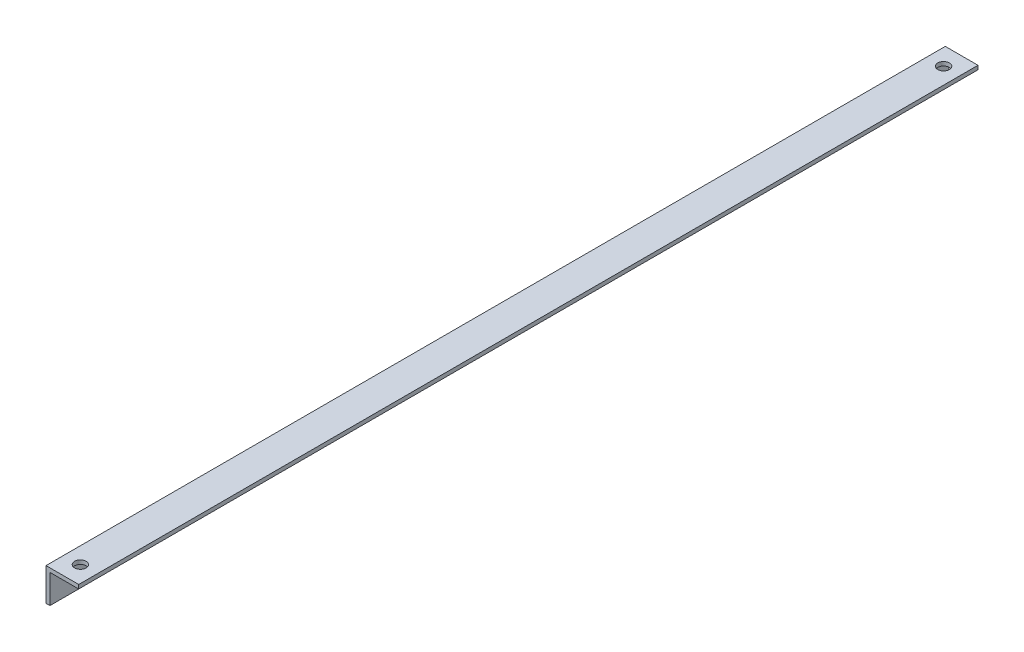
ISO-10303-21;
HEADER;
FILE_DESCRIPTION(('STEP AP214'),'2;1');
FILE_NAME('part.step','',(''),(''),'','','');
FILE_SCHEMA(('AUTOMOTIVE_DESIGN { 1 0 10303 214 1 1 1 1 }'));
ENDSEC;
DATA;
#1=APPLICATION_CONTEXT('core data for automotive mechanical design processes');
#2=APPLICATION_PROTOCOL_DEFINITION('international standard','automotive_design',2000,#1);
#3=PRODUCT_CONTEXT('',#1,'mechanical');
#4=PRODUCT('Part','Part','',(#3));
#5=PRODUCT_RELATED_PRODUCT_CATEGORY('part','',(#4));
#6=PRODUCT_DEFINITION_FORMATION('','',#4);
#7=PRODUCT_DEFINITION_CONTEXT('part definition',#1,'design');
#8=PRODUCT_DEFINITION('design','',#6,#7);
#9=PRODUCT_DEFINITION_SHAPE('','',#8);
#10=(LENGTH_UNIT() NAMED_UNIT(*) SI_UNIT(.MILLI.,.METRE.));
#11=(NAMED_UNIT(*) PLANE_ANGLE_UNIT() SI_UNIT($,.RADIAN.));
#12=(NAMED_UNIT(*) SI_UNIT($,.STERADIAN.) SOLID_ANGLE_UNIT());
#13=UNCERTAINTY_MEASURE_WITH_UNIT(LENGTH_MEASURE(1.E-05),#10,'distance_accuracy_value','');
#14=(GEOMETRIC_REPRESENTATION_CONTEXT(3) GLOBAL_UNCERTAINTY_ASSIGNED_CONTEXT((#13)) GLOBAL_UNIT_ASSIGNED_CONTEXT((#10,
#11,#12)) REPRESENTATION_CONTEXT('',''));
#15=CARTESIAN_POINT('',(0.,0.,0.));
#16=DIRECTION('',(0.,0.,1.));
#17=DIRECTION('',(1.,0.,0.));
#18=AXIS2_PLACEMENT_3D('',#15,#16,#17);
#19=CARTESIAN_POINT('',(0.,-12.7,349.));
#20=DIRECTION('',(1.,0.,0.));
#21=DIRECTION('',(0.,0.,-1.));
#22=AXIS2_PLACEMENT_3D('',#19,#20,#21);
#23=PLANE('',#22);
#24=CARTESIAN_POINT('',(0.,-6.35000000000005,65.553973));
#25=DIRECTION('',(-1.,0.,0.));
#26=DIRECTION('',(0.,0.,1.));
#27=AXIS2_PLACEMENT_3D('',#24,#25,#26);
#28=CIRCLE('',#27,1.65);
#29=CARTESIAN_POINT('',(0.,-6.35000000000005,67.203973));
#30=VERTEX_POINT('',#29);
#31=EDGE_CURVE('E202',#30,#30,#28,.T.);
#32=ORIENTED_EDGE('',*,*,#31,.F.);
#33=EDGE_LOOP('',(#32));
#34=FACE_BOUND('',#33,.T.);
#35=CARTESIAN_POINT('',(0.,-6.35000000000002,283.446027));
#36=DIRECTION('',(-1.,0.,0.));
#37=DIRECTION('',(0.,0.,1.));
#38=AXIS2_PLACEMENT_3D('',#35,#36,#37);
#39=CIRCLE('',#38,1.65);
#40=CARTESIAN_POINT('',(0.,-6.35000000000002,285.096027));
#41=VERTEX_POINT('',#40);
#42=EDGE_CURVE('E194',#41,#41,#39,.T.);
#43=ORIENTED_EDGE('',*,*,#42,.F.);
#44=EDGE_LOOP('',(#43));
#45=FACE_BOUND('',#44,.T.);
#46=DIRECTION('',(0.,-1.,0.));
#47=VECTOR('',#46,1.);
#48=CARTESIAN_POINT('',(0.,-12.7,0.));
#49=LINE('',#48,#47);
#50=CARTESIAN_POINT('',(0.,0.,0.));
#51=VERTEX_POINT('',#50);
#52=CARTESIAN_POINT('',(0.,-12.7,0.));
#53=VERTEX_POINT('',#52);
#54=EDGE_CURVE('E143',#51,#53,#49,.T.);
#55=ORIENTED_EDGE('',*,*,#54,.T.);
#56=DIRECTION('',(0.,0.,-1.));
#57=VECTOR('',#56,1.);
#58=CARTESIAN_POINT('',(0.,-12.7,349.));
#59=LINE('',#58,#57);
#60=CARTESIAN_POINT('',(0.,-12.7,349.));
#61=VERTEX_POINT('',#60);
#62=EDGE_CURVE('E11',#61,#53,#59,.T.);
#63=ORIENTED_EDGE('',*,*,#62,.F.);
#64=DIRECTION('',(0.,-1.,0.));
#65=VECTOR('',#64,1.);
#66=CARTESIAN_POINT('',(0.,-12.7,349.));
#67=LINE('',#66,#65);
#68=CARTESIAN_POINT('',(0.,0.,349.));
#69=VERTEX_POINT('',#68);
#70=EDGE_CURVE('E160',#69,#61,#67,.T.);
#71=ORIENTED_EDGE('',*,*,#70,.F.);
#72=DIRECTION('',(0.,0.,-1.));
#73=VECTOR('',#72,1.);
#74=CARTESIAN_POINT('',(0.,0.,349.));
#75=LINE('',#74,#73);
#76=EDGE_CURVE('E139',#69,#51,#75,.T.);
#77=ORIENTED_EDGE('',*,*,#76,.T.);
#78=EDGE_LOOP('',(#55,#63,#71,#77));
#79=FACE_BOUND('',#78,.T.);
#80=ADVANCED_FACE('F39',(#34,#45,#79),#23,.F.);
#81=CARTESIAN_POINT('',(1.524,-12.7,349.));
#82=DIRECTION('',(0.,1.,0.));
#83=DIRECTION('',(0.,0.,1.));
#84=AXIS2_PLACEMENT_3D('',#81,#82,#83);
#85=PLANE('',#84);
#86=DIRECTION('',(1.,0.,0.));
#87=VECTOR('',#86,1.);
#88=CARTESIAN_POINT('',(1.524,-12.7,0.));
#89=LINE('',#88,#87);
#90=CARTESIAN_POINT('',(1.524,-12.7,0.));
#91=VERTEX_POINT('',#90);
#92=EDGE_CURVE('E147',#53,#91,#89,.T.);
#93=ORIENTED_EDGE('',*,*,#92,.T.);
#94=DIRECTION('',(0.,0.,-1.));
#95=VECTOR('',#94,1.);
#96=CARTESIAN_POINT('',(1.524,-12.7,349.));
#97=LINE('',#96,#95);
#98=CARTESIAN_POINT('',(1.524,-12.7,349.));
#99=VERTEX_POINT('',#98);
#100=EDGE_CURVE('E49',#99,#91,#97,.T.);
#101=ORIENTED_EDGE('',*,*,#100,.F.);
#102=DIRECTION('',(1.,0.,0.));
#103=VECTOR('',#102,1.);
#104=CARTESIAN_POINT('',(1.524,-12.7,349.));
#105=LINE('',#104,#103);
#106=EDGE_CURVE('E105',#61,#99,#105,.T.);
#107=ORIENTED_EDGE('',*,*,#106,.F.);
#108=ORIENTED_EDGE('',*,*,#62,.T.);
#109=EDGE_LOOP('',(#93,#101,#107,#108));
#110=FACE_BOUND('',#109,.T.);
#111=ADVANCED_FACE('F224',(#110),#85,.F.);
#112=CARTESIAN_POINT('',(1.524,-1.524,349.));
#113=DIRECTION('',(-1.,0.,0.));
#114=DIRECTION('',(0.,-1.,0.));
#115=AXIS2_PLACEMENT_3D('',#112,#113,#114);
#116=PLANE('',#115);
#117=CARTESIAN_POINT('',(1.524,-6.35000000000005,65.553973));
#118=DIRECTION('',(-1.,0.,0.));
#119=DIRECTION('',(0.,-1.,0.));
#120=AXIS2_PLACEMENT_3D('',#117,#118,#119);
#121=CIRCLE('',#120,1.65);
#122=CARTESIAN_POINT('',(1.524,-8.00000000000005,65.553973));
#123=VERTEX_POINT('',#122);
#124=EDGE_CURVE('E42',#123,#123,#121,.T.);
#125=ORIENTED_EDGE('',*,*,#124,.T.);
#126=EDGE_LOOP('',(#125));
#127=FACE_BOUND('',#126,.T.);
#128=CARTESIAN_POINT('',(1.524,-6.35000000000002,283.446027));
#129=DIRECTION('',(-1.,0.,0.));
#130=DIRECTION('',(0.,-1.,0.));
#131=AXIS2_PLACEMENT_3D('',#128,#129,#130);
#132=CIRCLE('',#131,1.65);
#133=CARTESIAN_POINT('',(1.524,-8.00000000000002,283.446027));
#134=VERTEX_POINT('',#133);
#135=EDGE_CURVE('E192',#134,#134,#132,.T.);
#136=ORIENTED_EDGE('',*,*,#135,.T.);
#137=EDGE_LOOP('',(#136));
#138=FACE_BOUND('',#137,.T.);
#139=DIRECTION('',(0.,1.,0.));
#140=VECTOR('',#139,1.);
#141=CARTESIAN_POINT('',(1.524,-1.524,0.));
#142=LINE('',#141,#140);
#143=CARTESIAN_POINT('',(1.524,-1.524,0.));
#144=VERTEX_POINT('',#143);
#145=EDGE_CURVE('E151',#91,#144,#142,.T.);
#146=ORIENTED_EDGE('',*,*,#145,.T.);
#147=DIRECTION('',(0.,0.,-1.));
#148=VECTOR('',#147,1.);
#149=CARTESIAN_POINT('',(1.524,-1.524,349.));
#150=LINE('',#149,#148);
#151=CARTESIAN_POINT('',(1.524,-1.524,349.));
#152=VERTEX_POINT('',#151);
#153=EDGE_CURVE('E131',#152,#144,#150,.T.);
#154=ORIENTED_EDGE('',*,*,#153,.F.);
#155=DIRECTION('',(0.,1.,0.));
#156=VECTOR('',#155,1.);
#157=CARTESIAN_POINT('',(1.524,-1.524,349.));
#158=LINE('',#157,#156);
#159=EDGE_CURVE('E120',#99,#152,#158,.T.);
#160=ORIENTED_EDGE('',*,*,#159,.F.);
#161=ORIENTED_EDGE('',*,*,#100,.T.);
#162=EDGE_LOOP('',(#146,#154,#160,#161));
#163=FACE_BOUND('',#162,.T.);
#164=ADVANCED_FACE('F211',(#127,#138,#163),#116,.F.);
#165=CARTESIAN_POINT('',(12.7,-1.524,349.));
#166=DIRECTION('',(0.,1.,0.));
#167=DIRECTION('',(-1.,0.,0.));
#168=AXIS2_PLACEMENT_3D('',#165,#166,#167);
#169=PLANE('',#168);
#170=CARTESIAN_POINT('',(6.35,-1.524,7.));
#171=DIRECTION('',(0.,1.,0.));
#172=DIRECTION('',(-1.,0.,0.));
#173=AXIS2_PLACEMENT_3D('',#170,#171,#172);
#174=CIRCLE('',#173,2.24999999999997);
#175=CARTESIAN_POINT('',(4.10000000000003,-1.524,7.));
#176=VERTEX_POINT('',#175);
#177=EDGE_CURVE('E177',#176,#176,#174,.T.);
#178=ORIENTED_EDGE('',*,*,#177,.T.);
#179=EDGE_LOOP('',(#178));
#180=FACE_BOUND('',#179,.T.);
#181=CARTESIAN_POINT('',(6.35,-1.524,342.));
#182=DIRECTION('',(0.,1.,0.));
#183=DIRECTION('',(-1.,0.,0.));
#184=AXIS2_PLACEMENT_3D('',#181,#182,#183);
#185=CIRCLE('',#184,2.24999999999997);
#186=CARTESIAN_POINT('',(4.10000000000003,-1.524,342.));
#187=VERTEX_POINT('',#186);
#188=EDGE_CURVE('E148',#187,#187,#185,.T.);
#189=ORIENTED_EDGE('',*,*,#188,.T.);
#190=EDGE_LOOP('',(#189));
#191=FACE_BOUND('',#190,.T.);
#192=DIRECTION('',(1.,0.,0.));
#193=VECTOR('',#192,1.);
#194=CARTESIAN_POINT('',(12.7,-1.524,0.));
#195=LINE('',#194,#193);
#196=CARTESIAN_POINT('',(12.7,-1.524,0.));
#197=VERTEX_POINT('',#196);
#198=EDGE_CURVE('E129',#144,#197,#195,.T.);
#199=ORIENTED_EDGE('',*,*,#198,.T.);
#200=DIRECTION('',(0.,0.,-1.));
#201=VECTOR('',#200,1.);
#202=CARTESIAN_POINT('',(12.7,-1.524,349.));
#203=LINE('',#202,#201);
#204=CARTESIAN_POINT('',(12.7,-1.524,349.));
#205=VERTEX_POINT('',#204);
#206=EDGE_CURVE('E126',#205,#197,#203,.T.);
#207=ORIENTED_EDGE('',*,*,#206,.F.);
#208=DIRECTION('',(1.,0.,0.));
#209=VECTOR('',#208,1.);
#210=CARTESIAN_POINT('',(12.7,-1.524,349.));
#211=LINE('',#210,#209);
#212=EDGE_CURVE('E114',#152,#205,#211,.T.);
#213=ORIENTED_EDGE('',*,*,#212,.F.);
#214=ORIENTED_EDGE('',*,*,#153,.T.);
#215=EDGE_LOOP('',(#199,#207,#213,#214));
#216=FACE_BOUND('',#215,.T.);
#217=ADVANCED_FACE('F127',(#180,#191,#216),#169,.F.);
#218=CARTESIAN_POINT('',(12.7,0.,349.));
#219=DIRECTION('',(-1.,0.,0.));
#220=DIRECTION('',(0.,0.,1.));
#221=AXIS2_PLACEMENT_3D('',#218,#219,#220);
#222=PLANE('',#221);
#223=DIRECTION('',(0.,1.,0.));
#224=VECTOR('',#223,1.);
#225=CARTESIAN_POINT('',(12.7,0.,0.));
#226=LINE('',#225,#224);
#227=CARTESIAN_POINT('',(12.7,0.,0.));
#228=VERTEX_POINT('',#227);
#229=EDGE_CURVE('E89',#197,#228,#226,.T.);
#230=ORIENTED_EDGE('',*,*,#229,.T.);
#231=DIRECTION('',(0.,0.,-1.));
#232=VECTOR('',#231,1.);
#233=CARTESIAN_POINT('',(12.7,0.,349.));
#234=LINE('',#233,#232);
#235=CARTESIAN_POINT('',(12.7,0.,349.));
#236=VERTEX_POINT('',#235);
#237=EDGE_CURVE('E132',#236,#228,#234,.T.);
#238=ORIENTED_EDGE('',*,*,#237,.F.);
#239=DIRECTION('',(0.,1.,0.));
#240=VECTOR('',#239,1.);
#241=CARTESIAN_POINT('',(12.7,0.,349.));
#242=LINE('',#241,#240);
#243=EDGE_CURVE('E118',#205,#236,#242,.T.);
#244=ORIENTED_EDGE('',*,*,#243,.F.);
#245=ORIENTED_EDGE('',*,*,#206,.T.);
#246=EDGE_LOOP('',(#230,#238,#244,#245));
#247=FACE_BOUND('',#246,.T.);
#248=ADVANCED_FACE('F134',(#247),#222,.F.);
#249=CARTESIAN_POINT('',(0.,0.,349.));
#250=DIRECTION('',(0.,-1.,0.));
#251=DIRECTION('',(0.,0.,-1.));
#252=AXIS2_PLACEMENT_3D('',#249,#250,#251);
#253=PLANE('',#252);
#254=CARTESIAN_POINT('',(6.35,0.,7.));
#255=DIRECTION('',(0.,1.,0.));
#256=DIRECTION('',(0.,0.,1.));
#257=AXIS2_PLACEMENT_3D('',#254,#255,#256);
#258=CIRCLE('',#257,2.24999999999999);
#259=CARTESIAN_POINT('',(6.35,0.,9.24999999999999));
#260=VERTEX_POINT('',#259);
#261=EDGE_CURVE('E183',#260,#260,#258,.T.);
#262=ORIENTED_EDGE('',*,*,#261,.F.);
#263=EDGE_LOOP('',(#262));
#264=FACE_BOUND('',#263,.T.);
#265=CARTESIAN_POINT('',(6.35,0.,342.));
#266=DIRECTION('',(0.,1.,0.));
#267=DIRECTION('',(0.,0.,1.));
#268=AXIS2_PLACEMENT_3D('',#265,#266,#267);
#269=CIRCLE('',#268,2.24999999999999);
#270=CARTESIAN_POINT('',(6.35,0.,344.25));
#271=VERTEX_POINT('',#270);
#272=EDGE_CURVE('E171',#271,#271,#269,.T.);
#273=ORIENTED_EDGE('',*,*,#272,.F.);
#274=EDGE_LOOP('',(#273));
#275=FACE_BOUND('',#274,.T.);
#276=DIRECTION('',(-1.,0.,0.));
#277=VECTOR('',#276,1.);
#278=CARTESIAN_POINT('',(0.,0.,0.));
#279=LINE('',#278,#277);
#280=EDGE_CURVE('E96',#228,#51,#279,.T.);
#281=ORIENTED_EDGE('',*,*,#280,.T.);
#282=ORIENTED_EDGE('',*,*,#76,.F.);
#283=DIRECTION('',(-1.,0.,0.));
#284=VECTOR('',#283,1.);
#285=CARTESIAN_POINT('',(0.,0.,349.));
#286=LINE('',#285,#284);
#287=EDGE_CURVE('E61',#236,#69,#286,.T.);
#288=ORIENTED_EDGE('',*,*,#287,.F.);
#289=ORIENTED_EDGE('',*,*,#237,.T.);
#290=EDGE_LOOP('',(#281,#282,#288,#289));
#291=FACE_BOUND('',#290,.T.);
#292=ADVANCED_FACE('F249',(#264,#275,#291),#253,.F.);
#293=CARTESIAN_POINT('',(0.,0.,349.));
#294=DIRECTION('',(0.,0.,-1.));
#295=DIRECTION('',(-1.,0.,0.));
#296=AXIS2_PLACEMENT_3D('',#293,#294,#295);
#297=PLANE('',#296);
#298=ORIENTED_EDGE('',*,*,#70,.T.);
#299=ORIENTED_EDGE('',*,*,#106,.T.);
#300=ORIENTED_EDGE('',*,*,#159,.T.);
#301=ORIENTED_EDGE('',*,*,#212,.T.);
#302=ORIENTED_EDGE('',*,*,#243,.T.);
#303=ORIENTED_EDGE('',*,*,#287,.T.);
#304=EDGE_LOOP('',(#298,#299,#300,#301,#302,#303));
#305=FACE_BOUND('',#304,.T.);
#306=ADVANCED_FACE('F116',(#305),#297,.F.);
#307=CARTESIAN_POINT('',(0.,0.,0.));
#308=DIRECTION('',(0.,0.,-1.));
#309=DIRECTION('',(-1.,0.,0.));
#310=AXIS2_PLACEMENT_3D('',#307,#308,#309);
#311=PLANE('',#310);
#312=ORIENTED_EDGE('',*,*,#54,.F.);
#313=ORIENTED_EDGE('',*,*,#280,.F.);
#314=ORIENTED_EDGE('',*,*,#229,.F.);
#315=ORIENTED_EDGE('',*,*,#198,.F.);
#316=ORIENTED_EDGE('',*,*,#145,.F.);
#317=ORIENTED_EDGE('',*,*,#92,.F.);
#318=EDGE_LOOP('',(#312,#313,#314,#315,#316,#317));
#319=FACE_BOUND('',#318,.T.);
#320=ADVANCED_FACE('F236',(#319),#311,.T.);
#321=CARTESIAN_POINT('',(6.35,0.,342.));
#322=DIRECTION('',(0.,1.,0.));
#323=DIRECTION('',(0.,0.,1.));
#324=AXIS2_PLACEMENT_3D('',#321,#322,#323);
#325=CYLINDRICAL_SURFACE('',#324,2.24999999999997);
#326=ORIENTED_EDGE('',*,*,#272,.T.);
#327=EDGE_LOOP('',(#326));
#328=FACE_BOUND('',#327,.T.);
#329=ORIENTED_EDGE('',*,*,#188,.F.);
#330=EDGE_LOOP('',(#329));
#331=FACE_BOUND('',#330,.T.);
#332=ADVANCED_FACE('F255',(#328,#331),#325,.F.);
#333=CARTESIAN_POINT('',(6.35,0.,7.));
#334=DIRECTION('',(0.,1.,0.));
#335=DIRECTION('',(0.,0.,1.));
#336=AXIS2_PLACEMENT_3D('',#333,#334,#335);
#337=CYLINDRICAL_SURFACE('',#336,2.24999999999997);
#338=ORIENTED_EDGE('',*,*,#261,.T.);
#339=EDGE_LOOP('',(#338));
#340=FACE_BOUND('',#339,.T.);
#341=ORIENTED_EDGE('',*,*,#177,.F.);
#342=EDGE_LOOP('',(#341));
#343=FACE_BOUND('',#342,.T.);
#344=ADVANCED_FACE('F220',(#340,#343),#337,.F.);
#345=CARTESIAN_POINT('',(0.,-6.35000000000002,283.446027));
#346=DIRECTION('',(-1.,0.,0.));
#347=DIRECTION('',(0.,0.,1.));
#348=AXIS2_PLACEMENT_3D('',#345,#346,#347);
#349=CYLINDRICAL_SURFACE('',#348,1.65);
#350=ORIENTED_EDGE('',*,*,#42,.T.);
#351=EDGE_LOOP('',(#350));
#352=FACE_BOUND('',#351,.T.);
#353=ORIENTED_EDGE('',*,*,#135,.F.);
#354=EDGE_LOOP('',(#353));
#355=FACE_BOUND('',#354,.T.);
#356=ADVANCED_FACE('F215',(#352,#355),#349,.F.);
#357=CARTESIAN_POINT('',(0.,-6.35000000000005,65.553973));
#358=DIRECTION('',(-1.,0.,0.));
#359=DIRECTION('',(0.,0.,1.));
#360=AXIS2_PLACEMENT_3D('',#357,#358,#359);
#361=CYLINDRICAL_SURFACE('',#360,1.65);
#362=ORIENTED_EDGE('',*,*,#31,.T.);
#363=EDGE_LOOP('',(#362));
#364=FACE_BOUND('',#363,.T.);
#365=ORIENTED_EDGE('',*,*,#124,.F.);
#366=EDGE_LOOP('',(#365));
#367=FACE_BOUND('',#366,.T.);
#368=ADVANCED_FACE('F213',(#364,#367),#361,.F.);
#369=CLOSED_SHELL('',(#80,#111,#164,#217,#248,#292,#306,#320,#332,#344,#356,#368));
#370=MANIFOLD_SOLID_BREP('B2',#369);
#371=ADVANCED_BREP_SHAPE_REPRESENTATION('',(#18,#370),#14);
#372=SHAPE_DEFINITION_REPRESENTATION(#9,#371);
ENDSEC;
END-ISO-10303-21;
